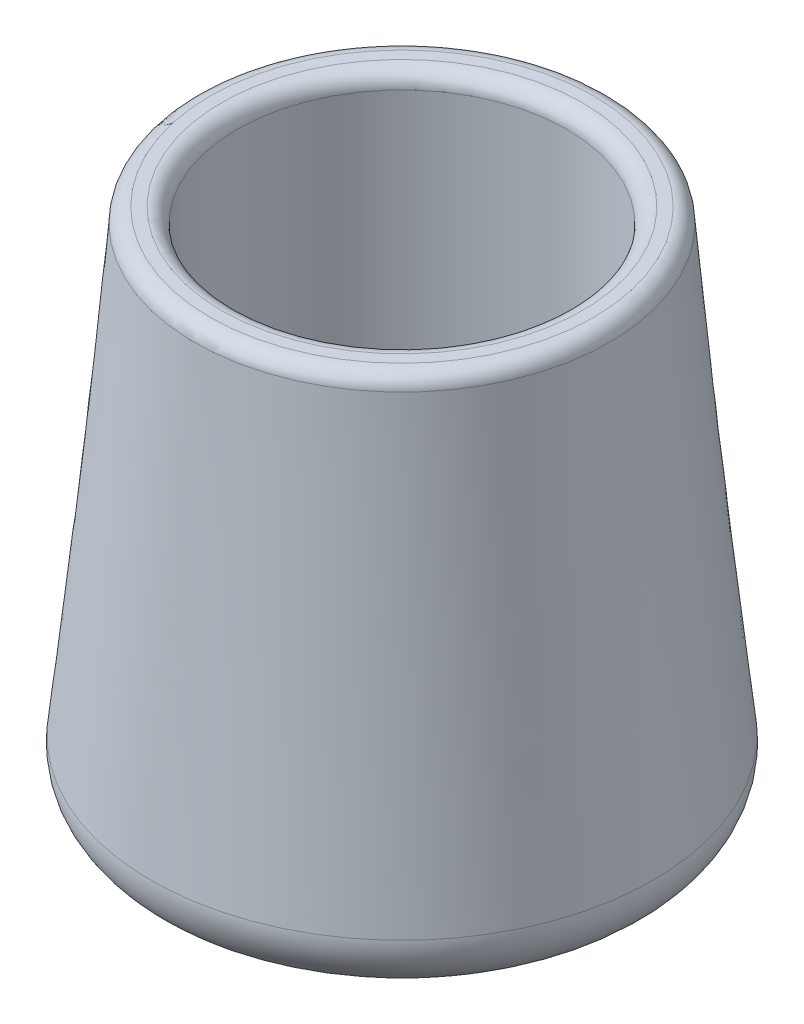
ISO-10303-21;
HEADER;
FILE_DESCRIPTION(('STEP AP214'),'2;1');
FILE_NAME('part.step','',(''),(''),'','','');
FILE_SCHEMA(('AUTOMOTIVE_DESIGN { 1 0 10303 214 1 1 1 1 }'));
ENDSEC;
DATA;
#1=APPLICATION_CONTEXT('core data for automotive mechanical design processes');
#2=APPLICATION_PROTOCOL_DEFINITION('international standard','automotive_design',2000,#1);
#3=PRODUCT_CONTEXT('',#1,'mechanical');
#4=PRODUCT('Part','Part','',(#3));
#5=PRODUCT_RELATED_PRODUCT_CATEGORY('part','',(#4));
#6=PRODUCT_DEFINITION_FORMATION('','',#4);
#7=PRODUCT_DEFINITION_CONTEXT('part definition',#1,'design');
#8=PRODUCT_DEFINITION('design','',#6,#7);
#9=PRODUCT_DEFINITION_SHAPE('','',#8);
#10=(LENGTH_UNIT() NAMED_UNIT(*) SI_UNIT(.MILLI.,.METRE.));
#11=(NAMED_UNIT(*) PLANE_ANGLE_UNIT() SI_UNIT($,.RADIAN.));
#12=(NAMED_UNIT(*) SI_UNIT($,.STERADIAN.) SOLID_ANGLE_UNIT());
#13=UNCERTAINTY_MEASURE_WITH_UNIT(LENGTH_MEASURE(1.E-05),#10,'distance_accuracy_value','');
#14=(GEOMETRIC_REPRESENTATION_CONTEXT(3) GLOBAL_UNCERTAINTY_ASSIGNED_CONTEXT((#13)) GLOBAL_UNIT_ASSIGNED_CONTEXT((#10,
#11,#12)) REPRESENTATION_CONTEXT('',''));
#15=CARTESIAN_POINT('',(0.,0.,0.));
#16=DIRECTION('',(0.,0.,1.));
#17=DIRECTION('',(1.,0.,0.));
#18=AXIS2_PLACEMENT_3D('',#15,#16,#17);
#19=CARTESIAN_POINT('',(0.,0.,0.));
#20=DIRECTION('',(0.,1.,0.));
#21=DIRECTION('',(0.,0.,1.));
#22=AXIS2_PLACEMENT_3D('',#19,#20,#21);
#23=PLANE('',#22);
#24=CARTESIAN_POINT('',(0.,0.,0.));
#25=DIRECTION('',(0.,1.,0.));
#26=DIRECTION('',(0.,0.,1.));
#27=AXIS2_PLACEMENT_3D('',#24,#25,#26);
#28=CIRCLE('',#27,9.85707860921831);
#29=CARTESIAN_POINT('',(0.,0.,9.85707860921831));
#30=VERTEX_POINT('',#29);
#31=EDGE_CURVE('E60',#30,#30,#28,.F.);
#32=ORIENTED_EDGE('',*,*,#31,.T.);
#33=EDGE_LOOP('',(#32));
#34=FACE_BOUND('',#33,.T.);
#35=ADVANCED_FACE('F40',(#34),#23,.F.);
#36=CARTESIAN_POINT('',(0.,25.4,0.));
#37=DIRECTION('',(0.,1.,0.));
#38=DIRECTION('',(0.,0.,1.));
#39=AXIS2_PLACEMENT_3D('',#36,#37,#38);
#40=PLANE('',#39);
#41=CARTESIAN_POINT('',(0.,25.4,0.));
#42=DIRECTION('',(0.,1.,0.));
#43=DIRECTION('',(0.,0.,1.));
#44=AXIS2_PLACEMENT_3D('',#41,#42,#43);
#45=CIRCLE('',#44,9.45853771657945);
#46=CARTESIAN_POINT('',(0.,25.4,9.45853771657945));
#47=VERTEX_POINT('',#46);
#48=EDGE_CURVE('E51',#47,#47,#45,.T.);
#49=ORIENTED_EDGE('',*,*,#48,.T.);
#50=EDGE_LOOP('',(#49));
#51=FACE_BOUND('',#50,.T.);
#52=CARTESIAN_POINT('',(0.,25.4,0.));
#53=DIRECTION('',(0.,1.,0.));
#54=DIRECTION('',(0.,0.,1.));
#55=AXIS2_PLACEMENT_3D('',#52,#53,#54);
#56=CIRCLE('',#55,8.89);
#57=CARTESIAN_POINT('',(0.,25.4,8.89));
#58=VERTEX_POINT('',#57);
#59=EDGE_CURVE('E55',#58,#58,#56,.F.);
#60=ORIENTED_EDGE('',*,*,#59,.T.);
#61=EDGE_LOOP('',(#60));
#62=FACE_BOUND('',#61,.T.);
#63=ADVANCED_FACE('F82',(#51,#62),#40,.T.);
#64=CARTESIAN_POINT('',(-6.38727815767262,25.4,7.9011567340813));
#65=CARTESIAN_POINT('',(-5.09499275632514,0.,11.6331873883727));
#66=CARTESIAN_POINT('',(-22.1895916258352,25.4,-4.87339958126393));
#67=CARTESIAN_POINT('',(-28.3613675330706,0.,1.44320187572246));
#68=CARTESIAN_POINT('',(-9.41503531048998,25.4,-20.6757130494265));
#69=CARTESIAN_POINT('',(-18.1713820204203,0.,-21.823172901023));
#70=CARTESIAN_POINT('',(6.38727815767262,25.4,-7.9011567340813));
#71=CARTESIAN_POINT('',(5.09499275632514,0.,-11.6331873883727));
#72=CARTESIAN_POINT('',(22.1895916258352,25.4,4.87339958126395));
#73=CARTESIAN_POINT('',(28.3613675330706,0.,-1.44320187572246));
#74=CARTESIAN_POINT('',(9.41503531048998,25.4,20.6757130494266));
#75=CARTESIAN_POINT('',(18.1713820204203,0.,21.823172901023));
#76=CARTESIAN_POINT('',(-6.38727815767262,25.4,7.9011567340813));
#77=CARTESIAN_POINT('',(-5.09499275632514,0.,11.6331873883727));
#78=(BOUNDED_SURFACE() B_SPLINE_SURFACE(3,1,((#64,#65),(#66,#67),(#68,#69),(#70,#71),(#72,#73),
(#74,#75),(#76,#77)),.UNSPECIFIED.,.T.,.F.,.F.) B_SPLINE_SURFACE_WITH_KNOTS((4,3,4),(2,2),(0.,
0.5,1.),(0.,1.),.UNSPECIFIED.) GEOMETRIC_REPRESENTATION_ITEM() RATIONAL_B_SPLINE_SURFACE(((1.,
1.),(0.333333333333333,0.333333333333333),(0.333333333333333,0.333333333333333),(1.,1.),
(0.333333333333333,0.333333333333333),(0.333333333333333,0.333333333333333),(1.,1.))) REPRESENTATION_ITEM('') SURFACE());
#79=CARTESIAN_POINT('',(0.,24.7013803494206,0.));
#80=DIRECTION('',(0.,-1.,0.));
#81=DIRECTION('',(0.,0.,-1.));
#82=AXIS2_PLACEMENT_3D('',#79,#80,#81);
#83=CIRCLE('',#82,10.217897269958);
#84=CARTESIAN_POINT('',(-6.35173422162781,24.7013803494206,8.00380515737472));
#85=VERTEX_POINT('',#84);
#86=EDGE_CURVE('E47',#85,#85,#83,.T.);
#87=CARTESIAN_POINT('',(0.,2.82172767256725,0.));
#88=DIRECTION('',(0.,-1.,0.));
#89=DIRECTION('',(0.,0.,-1.));
#90=AXIS2_PLACEMENT_3D('',#87,#88,#89);
#91=CIRCLE('',#90,12.3814061471004);
#92=CARTESIAN_POINT('',(-5.23855486175179,2.82172767256725,11.218589980023));
#93=VERTEX_POINT('',#92);
#94=EDGE_CURVE('E63',#93,#93,#91,.F.);
#95=CARTESIAN_POINT('',(-6.35173422162781,24.7013803494206,8.00380515737472));
#96=CARTESIAN_POINT('',(-6.34013860329576,24.4734673007033,8.03729249927731));
#97=CARTESIAN_POINT('',(-6.32854298496372,24.2455542519861,8.07077984117989));
#98=CARTESIAN_POINT('',(-6.30535174829964,23.7897281545517,8.13775452498506));
#99=CARTESIAN_POINT('',(-6.29375612996759,23.5618151058344,8.17124186688765));
#100=CARTESIAN_POINT('',(-6.27056489330351,23.1059890084,8.23821655069282));
#101=CARTESIAN_POINT('',(-6.25896927497147,22.8780759596828,8.27170389259541));
#102=CARTESIAN_POINT('',(-6.23577803830739,22.4222498622483,8.33867857640058));
#103=CARTESIAN_POINT('',(-6.22418241997534,22.1943368135311,8.37216591830317));
#104=CARTESIAN_POINT('',(-6.20099118331126,21.7385107160967,8.43914060210834));
#105=CARTESIAN_POINT('',(-6.18939556497922,21.5105976673794,8.47262794401093));
#106=CARTESIAN_POINT('',(-6.16620432831513,21.054771569945,8.5396026278161));
#107=CARTESIAN_POINT('',(-6.15460870998309,20.8268585212278,8.57308996971869));
#108=CARTESIAN_POINT('',(-6.13141747331901,20.3710324237933,8.64006465352386));
#109=CARTESIAN_POINT('',(-6.11982185498697,20.1431193750761,8.67355199542644));
#110=CARTESIAN_POINT('',(-6.09663061832288,19.6872932776417,8.74052667923162));
#111=CARTESIAN_POINT('',(-6.08503499999084,19.4593802289244,8.7740140211342));
#112=CARTESIAN_POINT('',(-6.06184376332676,19.00355413149,8.84098870493937));
#113=CARTESIAN_POINT('',(-6.05024814499472,18.7756410827728,8.87447604684196));
#114=CARTESIAN_POINT('',(-6.02705690833063,18.3198149853383,8.94145073064713));
#115=CARTESIAN_POINT('',(-6.01546128999859,18.0919019366211,8.97493807254972));
#116=CARTESIAN_POINT('',(-5.99227005333451,17.6360758391867,9.04191275635489));
#117=CARTESIAN_POINT('',(-5.98067443500246,17.4081627904695,9.07540009825748));
#118=CARTESIAN_POINT('',(-5.95748319833838,16.952336693035,9.14237478206265));
#119=CARTESIAN_POINT('',(-5.94588758000634,16.7244236443178,9.17586212396523));
#120=CARTESIAN_POINT('',(-5.92269634334226,16.2685975468833,9.24283680777041));
#121=CARTESIAN_POINT('',(-5.91110072501021,16.0406844981661,9.27632414967299));
#122=CARTESIAN_POINT('',(-5.88790948834613,15.5848584007317,9.34329883347817));
#123=CARTESIAN_POINT('',(-5.87631387001409,15.3569453520145,9.37678617538075));
#124=CARTESIAN_POINT('',(-5.85312263335,14.90111925458,9.44376085918593));
#125=CARTESIAN_POINT('',(-5.84152701501796,14.6732062058628,9.47724820108851));
#126=CARTESIAN_POINT('',(-5.81833577835388,14.2173801084283,9.54422288489368));
#127=CARTESIAN_POINT('',(-5.80674016002184,13.9894670597111,9.57771022679627));
#128=CARTESIAN_POINT('',(-5.78354892335775,13.5336409622767,9.64468491060144));
#129=CARTESIAN_POINT('',(-5.77195330502571,13.3057279135595,9.67817225250403));
#130=CARTESIAN_POINT('',(-5.74876206836163,12.849901816125,9.7451469363092));
#131=CARTESIAN_POINT('',(-5.73716645002959,12.6219887674078,9.77863427821179));
#132=CARTESIAN_POINT('',(-5.7139752133655,12.1661626699733,9.84560896201696));
#133=CARTESIAN_POINT('',(-5.70237959503346,11.9382496212561,9.87909630391954));
#134=CARTESIAN_POINT('',(-5.67918835836938,11.4824235238217,9.94607098772472));
#135=CARTESIAN_POINT('',(-5.66759274003733,11.2545104751045,9.9795583296273));
#136=CARTESIAN_POINT('',(-5.64440150337325,10.79868437767,10.0465330134325));
#137=CARTESIAN_POINT('',(-5.63280588504121,10.5707713289528,10.0800203553351));
#138=CARTESIAN_POINT('',(-5.60961464837712,10.1149452315184,10.1469950391402));
#139=CARTESIAN_POINT('',(-5.59801903004508,9.88703218280113,10.1804823810428));
#140=CARTESIAN_POINT('',(-5.574827793381,9.43120608536669,10.247457064848));
#141=CARTESIAN_POINT('',(-5.56323217504896,9.20329303664946,10.2809444067506));
#142=CARTESIAN_POINT('',(-5.54004093838487,8.74746693921502,10.3479190905558));
#143=CARTESIAN_POINT('',(-5.52844532005283,8.5195538904978,10.3814064324583));
#144=CARTESIAN_POINT('',(-5.50525408338875,8.06372779306335,10.4483811162635));
#145=CARTESIAN_POINT('',(-5.49365846505671,7.83581474434613,10.4818684581661));
#146=CARTESIAN_POINT('',(-5.47046722839262,7.37998864691169,10.5488431419713));
#147=CARTESIAN_POINT('',(-5.45887161006058,7.15207559819447,10.5823304838739));
#148=CARTESIAN_POINT('',(-5.4356803733965,6.69624950076002,10.649305167679));
#149=CARTESIAN_POINT('',(-5.42408475506446,6.4683364520428,10.6827925095816));
#150=CARTESIAN_POINT('',(-5.40089351840037,6.01251035460835,10.7497671933868));
#151=CARTESIAN_POINT('',(-5.38929790006833,5.78459730589113,10.7832545352894));
#152=CARTESIAN_POINT('',(-5.36610666340425,5.32877120845669,10.8502292190945));
#153=CARTESIAN_POINT('',(-5.3545110450722,5.10085815973947,10.8837165609971));
#154=CARTESIAN_POINT('',(-5.33131980840812,4.64503206230502,10.9506912448023));
#155=CARTESIAN_POINT('',(-5.31972419007608,4.4171190135878,10.9841785867049));
#156=CARTESIAN_POINT('',(-5.29653295341199,3.96129291615336,11.0511532705101));
#157=CARTESIAN_POINT('',(-5.28493733507995,3.73337986743614,11.0846406124126));
#158=CARTESIAN_POINT('',(-5.26174609841587,3.27755377000169,11.1516152962178));
#159=CARTESIAN_POINT('',(-5.25015048008383,3.04964072128447,11.1851026381204));
#160=CARTESIAN_POINT('',(-5.23855486175179,2.82172767256725,11.218589980023));
#161=B_SPLINE_CURVE_WITH_KNOTS('',3,(#95,#96,#97,#98,#99,#100,#101,#102,#103,#104,#105,#106,
#107,#108,#109,#110,#111,#112,#113,#114,#115,#116,#117,#118,#119,#120,#121,#122,#123,#124,#125,
#126,#127,#128,#129,#130,#131,#132,#133,#134,#135,#136,#137,#138,#139,#140,#141,#142,#143,#144,
#145,#146,#147,#148,#149,#150,#151,#152,#153,#154,#155,#156,#157,#158,#159,#160),.UNSPECIFIED.,
.F.,.F.,(4,2,2,2,2,2,2,2,2,2,2,2,2,2,2,2,2,2,2,2,2,2,2,2,2,2,2,2,2,2,2,2,4),(0.,
0.691955174754866,1.38391034950973,2.0758655242646,2.76782069901946,3.45977587377433,
4.15173104852919,4.84368622328406,5.53564139803893,6.22759657279379,6.91955174754866,
7.61150692230353,8.30346209705839,8.99541727181325,9.68737244656812,10.379327621323,
11.0712827960779,11.7632379708327,12.4551931455876,13.1471483203424,13.8391034950973,
14.5310586698522,15.223013844607,15.9149690193619,16.6069241941168,17.2988793688716,
17.9908345436265,18.6827897183814,19.3747448931362,20.0667000678911,20.758655242646,
21.4506104174008,22.1425655921557),.UNSPECIFIED.);
#162=EDGE_CURVE('BSEAM74',#85,#93,#161,.T.);
#163=ORIENTED_EDGE('',*,*,#86,.T.);
#164=ORIENTED_EDGE('',*,*,#94,.T.);
#165=ORIENTED_EDGE('',*,*,#162,.T.);
#166=ORIENTED_EDGE('',*,*,#162,.F.);
#167=EDGE_LOOP('',(#163,#165,#164,#166));
#168=FACE_BOUND('',#167,.T.);
#169=ADVANCED_FACE('F74',(#168),#78,.T.);
#170=CARTESIAN_POINT('',(0.,12.7,0.));
#171=DIRECTION('',(0.,1.,0.));
#172=DIRECTION('',(0.,0.,1.));
#173=AXIS2_PLACEMENT_3D('',#170,#171,#172);
#174=CYLINDRICAL_SURFACE('',#173,8.128);
#175=CARTESIAN_POINT('',(0.,24.638,0.));
#176=DIRECTION('',(0.,1.,0.));
#177=DIRECTION('',(0.,0.,1.));
#178=AXIS2_PLACEMENT_3D('',#175,#176,#177);
#179=CIRCLE('',#178,8.128);
#180=CARTESIAN_POINT('',(0.,24.638,8.128));
#181=VERTEX_POINT('',#180);
#182=EDGE_CURVE('E11',#181,#181,#179,.T.);
#183=ORIENTED_EDGE('',*,*,#182,.T.);
#184=EDGE_LOOP('',(#183));
#185=FACE_BOUND('',#184,.T.);
#186=CARTESIAN_POINT('',(0.,12.7,0.));
#187=DIRECTION('',(0.,1.,0.));
#188=DIRECTION('',(0.,0.,1.));
#189=AXIS2_PLACEMENT_3D('',#186,#187,#188);
#190=CIRCLE('',#189,8.128);
#191=CARTESIAN_POINT('',(0.,12.7,8.128));
#192=VERTEX_POINT('',#191);
#193=EDGE_CURVE('E66',#192,#192,#190,.T.);
#194=ORIENTED_EDGE('',*,*,#193,.F.);
#195=EDGE_LOOP('',(#194));
#196=FACE_BOUND('',#195,.T.);
#197=ADVANCED_FACE('F72',(#185,#196),#174,.F.);
#198=CARTESIAN_POINT('',(0.,12.7,0.));
#199=DIRECTION('',(0.,1.,0.));
#200=DIRECTION('',(0.,0.,1.));
#201=AXIS2_PLACEMENT_3D('',#198,#199,#200);
#202=PLANE('',#201);
#203=ORIENTED_EDGE('',*,*,#193,.T.);
#204=EDGE_LOOP('',(#203));
#205=FACE_BOUND('',#204,.T.);
#206=ADVANCED_FACE('F70',(#205),#202,.T.);
#207=CARTESIAN_POINT('',(0.,2.54,0.));
#208=DIRECTION('',(0.,-1.,0.));
#209=DIRECTION('',(0.,0.,-1.));
#210=AXIS2_PLACEMENT_3D('',#207,#208,#209);
#211=TOROIDAL_SURFACE('',#210,9.85707860921831,2.54);
#212=ORIENTED_EDGE('',*,*,#31,.F.);
#213=EDGE_LOOP('',(#212));
#214=FACE_BOUND('',#213,.T.);
#215=ORIENTED_EDGE('',*,*,#94,.F.);
#216=EDGE_LOOP('',(#215));
#217=FACE_BOUND('',#216,.T.);
#218=ADVANCED_FACE('F80',(#214,#217),#211,.T.);
#219=CARTESIAN_POINT('',(0.,24.638,0.));
#220=DIRECTION('',(0.,-1.,0.));
#221=DIRECTION('',(0.,0.,-1.));
#222=AXIS2_PLACEMENT_3D('',#219,#220,#221);
#223=TOROIDAL_SURFACE('',#222,9.45853771657945,0.762);
#224=ORIENTED_EDGE('',*,*,#86,.F.);
#225=EDGE_LOOP('',(#224));
#226=FACE_BOUND('',#225,.T.);
#227=ORIENTED_EDGE('',*,*,#48,.F.);
#228=EDGE_LOOP('',(#227));
#229=FACE_BOUND('',#228,.T.);
#230=ADVANCED_FACE('F96',(#226,#229),#223,.T.);
#231=CARTESIAN_POINT('',(0.,24.638,0.));
#232=DIRECTION('',(0.,1.,0.));
#233=DIRECTION('',(0.,0.,1.));
#234=AXIS2_PLACEMENT_3D('',#231,#232,#233);
#235=TOROIDAL_SURFACE('',#234,8.89,0.762);
#236=ORIENTED_EDGE('',*,*,#59,.F.);
#237=EDGE_LOOP('',(#236));
#238=FACE_BOUND('',#237,.T.);
#239=ORIENTED_EDGE('',*,*,#182,.F.);
#240=EDGE_LOOP('',(#239));
#241=FACE_BOUND('',#240,.T.);
#242=ADVANCED_FACE('F42',(#238,#241),#235,.T.);
#243=CLOSED_SHELL('',(#35,#63,#169,#197,#206,#218,#230,#242));
#244=MANIFOLD_SOLID_BREP('B2',#243);
#245=ADVANCED_BREP_SHAPE_REPRESENTATION('',(#18,#244),#14);
#246=SHAPE_DEFINITION_REPRESENTATION(#9,#245);
ENDSEC;
END-ISO-10303-21;
